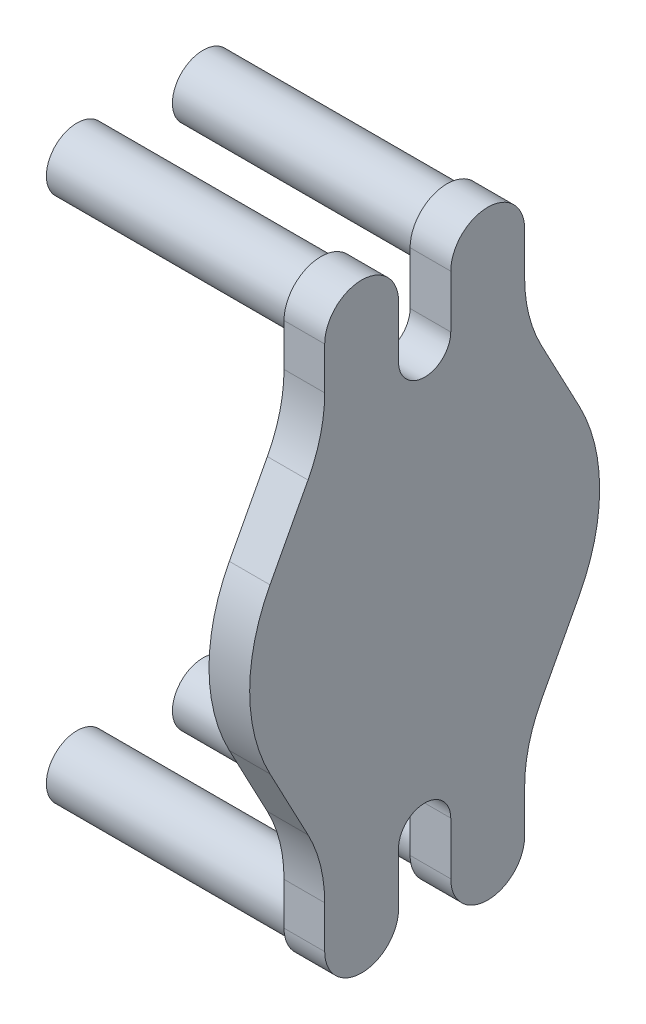
ISO-10303-21;
HEADER;
FILE_DESCRIPTION(('STEP AP214'),'2;1');
FILE_NAME('part.step','',(''),(''),'','','');
FILE_SCHEMA(('AUTOMOTIVE_DESIGN { 1 0 10303 214 1 1 1 1 }'));
ENDSEC;
DATA;
#1=APPLICATION_CONTEXT('core data for automotive mechanical design processes');
#2=APPLICATION_PROTOCOL_DEFINITION('international standard','automotive_design',2000,#1);
#3=PRODUCT_CONTEXT('',#1,'mechanical');
#4=PRODUCT('Part','Part','',(#3));
#5=PRODUCT_RELATED_PRODUCT_CATEGORY('part','',(#4));
#6=PRODUCT_DEFINITION_FORMATION('','',#4);
#7=PRODUCT_DEFINITION_CONTEXT('part definition',#1,'design');
#8=PRODUCT_DEFINITION('design','',#6,#7);
#9=PRODUCT_DEFINITION_SHAPE('','',#8);
#10=(LENGTH_UNIT() NAMED_UNIT(*) SI_UNIT(.MILLI.,.METRE.));
#11=(NAMED_UNIT(*) PLANE_ANGLE_UNIT() SI_UNIT($,.RADIAN.));
#12=(NAMED_UNIT(*) SI_UNIT($,.STERADIAN.) SOLID_ANGLE_UNIT());
#13=UNCERTAINTY_MEASURE_WITH_UNIT(LENGTH_MEASURE(1.E-05),#10,'distance_accuracy_value','');
#14=(GEOMETRIC_REPRESENTATION_CONTEXT(3) GLOBAL_UNCERTAINTY_ASSIGNED_CONTEXT((#13)) GLOBAL_UNIT_ASSIGNED_CONTEXT((#10,
#11,#12)) REPRESENTATION_CONTEXT('',''));
#15=CARTESIAN_POINT('',(0.,0.,0.));
#16=DIRECTION('',(0.,0.,1.));
#17=DIRECTION('',(1.,0.,0.));
#18=AXIS2_PLACEMENT_3D('',#15,#16,#17);
#19=CARTESIAN_POINT('',(33.9,17.1151545626375,32.3245303182742));
#20=DIRECTION('',(0.,-0.467934015820141,-0.883763405464628));
#21=DIRECTION('',(0.,0.883763405464628,-0.467934015820141));
#22=AXIS2_PLACEMENT_3D('',#19,#20,#21);
#23=PLANE('',#22);
#24=DIRECTION('',(0.,-0.883763405464628,0.467934015820141));
#25=VECTOR('',#24,1.);
#26=CARTESIAN_POINT('',(25.4,17.1151545626375,32.3245303182742));
#27=LINE('',#26,#25);
#28=CARTESIAN_POINT('',(25.4,32.1151545626375,24.3823478360612));
#29=VERTEX_POINT('',#28);
#30=CARTESIAN_POINT('',(25.4,17.1151545626375,32.3245303182742));
#31=VERTEX_POINT('',#30);
#32=EDGE_CURVE('E231',#29,#31,#27,.T.);
#33=ORIENTED_EDGE('',*,*,#32,.T.);
#34=DIRECTION('',(-1.,0.,0.));
#35=VECTOR('',#34,1.);
#36=CARTESIAN_POINT('',(33.9,17.1151545626375,32.3245303182742));
#37=LINE('',#36,#35);
#38=CARTESIAN_POINT('',(33.9,17.1151545626375,32.3245303182742));
#39=VERTEX_POINT('',#38);
#40=EDGE_CURVE('E340',#39,#31,#37,.T.);
#41=ORIENTED_EDGE('',*,*,#40,.F.);
#42=DIRECTION('',(0.,-0.883763405464628,0.467934015820141));
#43=VECTOR('',#42,1.);
#44=CARTESIAN_POINT('',(33.9,17.1151545626375,32.3245303182742));
#45=LINE('',#44,#43);
#46=CARTESIAN_POINT('',(33.9,32.1151545626375,24.3823478360612));
#47=VERTEX_POINT('',#46);
#48=EDGE_CURVE('E290',#47,#39,#45,.T.);
#49=ORIENTED_EDGE('',*,*,#48,.F.);
#50=DIRECTION('',(-1.,0.,0.));
#51=VECTOR('',#50,1.);
#52=CARTESIAN_POINT('',(33.9,32.1151545626375,24.3823478360612));
#53=LINE('',#52,#51);
#54=EDGE_CURVE('E227',#47,#29,#53,.T.);
#55=ORIENTED_EDGE('',*,*,#54,.T.);
#56=EDGE_LOOP('',(#33,#41,#49,#55));
#57=FACE_BOUND('',#56,.T.);
#58=ADVANCED_FACE('F37',(#57),#23,.F.);
#59=CARTESIAN_POINT('',(33.9,0.,0.));
#60=DIRECTION('',(-1.,0.,0.));
#61=DIRECTION('',(0.,-1.,0.));
#62=AXIS2_PLACEMENT_3D('',#59,#60,#61);
#63=CYLINDRICAL_SURFACE('',#62,36.576);
#64=CARTESIAN_POINT('',(25.4,0.,0.));
#65=DIRECTION('',(1.,0.,0.));
#66=DIRECTION('',(0.,1.,0.));
#67=AXIS2_PLACEMENT_3D('',#64,#65,#66);
#68=CIRCLE('',#67,36.576);
#69=CARTESIAN_POINT('',(25.4,-17.1151545626375,32.3245303182742));
#70=VERTEX_POINT('',#69);
#71=EDGE_CURVE('E234',#31,#70,#68,.T.);
#72=ORIENTED_EDGE('',*,*,#71,.T.);
#73=DIRECTION('',(-1.,0.,0.));
#74=VECTOR('',#73,1.);
#75=CARTESIAN_POINT('',(33.9,-17.1151545626374,32.3245303182742));
#76=LINE('',#75,#74);
#77=CARTESIAN_POINT('',(33.9,-17.1151545626374,32.3245303182742));
#78=VERTEX_POINT('',#77);
#79=EDGE_CURVE('E338',#78,#70,#76,.T.);
#80=ORIENTED_EDGE('',*,*,#79,.F.);
#81=CARTESIAN_POINT('',(33.9,0.,0.));
#82=DIRECTION('',(1.,0.,0.));
#83=DIRECTION('',(0.,1.,0.));
#84=AXIS2_PLACEMENT_3D('',#81,#82,#83);
#85=CIRCLE('',#84,36.576);
#86=EDGE_CURVE('E146',#39,#78,#85,.T.);
#87=ORIENTED_EDGE('',*,*,#86,.F.);
#88=ORIENTED_EDGE('',*,*,#40,.T.);
#89=EDGE_LOOP('',(#72,#80,#87,#88));
#90=FACE_BOUND('',#89,.T.);
#91=ADVANCED_FACE('F379',(#90),#63,.T.);
#92=CARTESIAN_POINT('',(33.9,-17.1151545626375,32.3245303182742));
#93=DIRECTION('',(0.,-0.467934015820141,0.883763405464628));
#94=DIRECTION('',(0.,-0.883763405464628,-0.467934015820141));
#95=AXIS2_PLACEMENT_3D('',#92,#93,#94);
#96=PLANE('',#95);
#97=DIRECTION('',(0.,0.883763405464628,0.467934015820141));
#98=VECTOR('',#97,1.);
#99=CARTESIAN_POINT('',(25.4,-17.1151545626375,32.3245303182742));
#100=LINE('',#99,#98);
#101=CARTESIAN_POINT('',(25.4,-32.1151545626375,24.3823478360612));
#102=VERTEX_POINT('',#101);
#103=EDGE_CURVE('E238',#102,#70,#100,.T.);
#104=ORIENTED_EDGE('',*,*,#103,.F.);
#105=DIRECTION('',(-1.,0.,0.));
#106=VECTOR('',#105,1.);
#107=CARTESIAN_POINT('',(33.9,-32.1151545626374,24.3823478360612));
#108=LINE('',#107,#106);
#109=CARTESIAN_POINT('',(33.9,-32.1151545626374,24.3823478360612));
#110=VERTEX_POINT('',#109);
#111=EDGE_CURVE('E336',#110,#102,#108,.T.);
#112=ORIENTED_EDGE('',*,*,#111,.F.);
#113=DIRECTION('',(0.,0.883763405464628,0.467934015820141));
#114=VECTOR('',#113,1.);
#115=CARTESIAN_POINT('',(33.9,-17.1151545626375,32.3245303182742));
#116=LINE('',#115,#114);
#117=EDGE_CURVE('E706',#110,#78,#116,.T.);
#118=ORIENTED_EDGE('',*,*,#117,.T.);
#119=ORIENTED_EDGE('',*,*,#79,.T.);
#120=EDGE_LOOP('',(#104,#112,#118,#119));
#121=FACE_BOUND('',#120,.T.);
#122=ADVANCED_FACE('F383',(#121),#96,.T.);
#123=CARTESIAN_POINT('',(33.9,-46.1531750372417,50.89525));
#124=DIRECTION('',(-1.,0.,0.));
#125=DIRECTION('',(0.,-1.,0.));
#126=AXIS2_PLACEMENT_3D('',#123,#124,#125);
#127=CYLINDRICAL_SURFACE('',#126,30.);
#128=CARTESIAN_POINT('',(25.4,-46.1531750372417,50.89525));
#129=DIRECTION('',(1.,0.,0.));
#130=DIRECTION('',(0.,1.,0.));
#131=AXIS2_PLACEMENT_3D('',#128,#129,#130);
#132=CIRCLE('',#131,30.);
#133=CARTESIAN_POINT('',(25.4,-46.1531750372417,20.89525));
#134=VERTEX_POINT('',#133);
#135=EDGE_CURVE('E241',#134,#102,#132,.T.);
#136=ORIENTED_EDGE('',*,*,#135,.F.);
#137=DIRECTION('',(-1.,0.,0.));
#138=VECTOR('',#137,1.);
#139=CARTESIAN_POINT('',(33.9,-46.1531750372417,20.89525));
#140=LINE('',#139,#138);
#141=CARTESIAN_POINT('',(33.9,-46.1531750372417,20.89525));
#142=VERTEX_POINT('',#141);
#143=EDGE_CURVE('E334',#142,#134,#140,.T.);
#144=ORIENTED_EDGE('',*,*,#143,.F.);
#145=CARTESIAN_POINT('',(33.9,-46.1531750372417,50.89525));
#146=DIRECTION('',(1.,0.,0.));
#147=DIRECTION('',(0.,1.,0.));
#148=AXIS2_PLACEMENT_3D('',#145,#146,#147);
#149=CIRCLE('',#148,30.);
#150=EDGE_CURVE('E709',#142,#110,#149,.T.);
#151=ORIENTED_EDGE('',*,*,#150,.T.);
#152=ORIENTED_EDGE('',*,*,#111,.T.);
#153=EDGE_LOOP('',(#136,#144,#151,#152));
#154=FACE_BOUND('',#153,.T.);
#155=ADVANCED_FACE('F387',(#154),#127,.F.);
#156=CARTESIAN_POINT('',(33.9,0.,20.89525));
#157=DIRECTION('',(0.,0.,1.));
#158=DIRECTION('',(0.,-1.,0.));
#159=AXIS2_PLACEMENT_3D('',#156,#157,#158);
#160=PLANE('',#159);
#161=DIRECTION('',(0.,1.,0.));
#162=VECTOR('',#161,1.);
#163=CARTESIAN_POINT('',(25.4,0.,20.89525));
#164=LINE('',#163,#162);
#165=CARTESIAN_POINT('',(25.4,-55.,20.89525));
#166=VERTEX_POINT('',#165);
#167=EDGE_CURVE('E244',#166,#134,#164,.T.);
#168=ORIENTED_EDGE('',*,*,#167,.F.);
#169=DIRECTION('',(-1.,0.,0.));
#170=VECTOR('',#169,1.);
#171=CARTESIAN_POINT('',(33.9,-55.,20.89525));
#172=LINE('',#171,#170);
#173=CARTESIAN_POINT('',(33.9,-55.,20.89525));
#174=VERTEX_POINT('',#173);
#175=EDGE_CURVE('E332',#174,#166,#172,.T.);
#176=ORIENTED_EDGE('',*,*,#175,.F.);
#177=DIRECTION('',(0.,1.,0.));
#178=VECTOR('',#177,1.);
#179=CARTESIAN_POINT('',(33.9,0.,20.89525));
#180=LINE('',#179,#178);
#181=EDGE_CURVE('E712',#174,#142,#180,.T.);
#182=ORIENTED_EDGE('',*,*,#181,.T.);
#183=ORIENTED_EDGE('',*,*,#143,.T.);
#184=EDGE_LOOP('',(#168,#176,#182,#183));
#185=FACE_BOUND('',#184,.T.);
#186=ADVANCED_FACE('F393',(#185),#160,.T.);
#187=CARTESIAN_POINT('',(33.9,-55.,13.175));
#188=DIRECTION('',(-1.,0.,0.));
#189=DIRECTION('',(0.,-1.,0.));
#190=AXIS2_PLACEMENT_3D('',#187,#188,#189);
#191=CYLINDRICAL_SURFACE('',#190,7.72025);
#192=CARTESIAN_POINT('',(25.4,-55.,13.175));
#193=DIRECTION('',(1.,0.,0.));
#194=DIRECTION('',(0.,1.,0.));
#195=AXIS2_PLACEMENT_3D('',#192,#193,#194);
#196=CIRCLE('',#195,7.72025);
#197=CARTESIAN_POINT('',(25.4,-55.,5.45475));
#198=VERTEX_POINT('',#197);
#199=EDGE_CURVE('E247',#166,#198,#196,.T.);
#200=ORIENTED_EDGE('',*,*,#199,.T.);
#201=DIRECTION('',(-1.,0.,0.));
#202=VECTOR('',#201,1.);
#203=CARTESIAN_POINT('',(33.9,-55.,5.45475));
#204=LINE('',#203,#202);
#205=CARTESIAN_POINT('',(33.9,-55.,5.45475));
#206=VERTEX_POINT('',#205);
#207=EDGE_CURVE('E329',#206,#198,#204,.T.);
#208=ORIENTED_EDGE('',*,*,#207,.F.);
#209=CARTESIAN_POINT('',(33.9,-55.,13.175));
#210=DIRECTION('',(1.,0.,0.));
#211=DIRECTION('',(0.,1.,0.));
#212=AXIS2_PLACEMENT_3D('',#209,#210,#211);
#213=CIRCLE('',#212,7.72025);
#214=EDGE_CURVE('E715',#174,#206,#213,.T.);
#215=ORIENTED_EDGE('',*,*,#214,.F.);
#216=ORIENTED_EDGE('',*,*,#175,.T.);
#217=EDGE_LOOP('',(#200,#208,#215,#216));
#218=FACE_BOUND('',#217,.T.);
#219=ADVANCED_FACE('F397',(#218),#191,.T.);
#220=CARTESIAN_POINT('',(33.9,0.,5.45475000000001));
#221=DIRECTION('',(0.,0.,1.));
#222=DIRECTION('',(0.,-1.,0.));
#223=AXIS2_PLACEMENT_3D('',#220,#221,#222);
#224=PLANE('',#223);
#225=DIRECTION('',(0.,1.,0.));
#226=VECTOR('',#225,1.);
#227=CARTESIAN_POINT('',(25.4,0.,5.45475000000001));
#228=LINE('',#227,#226);
#229=CARTESIAN_POINT('',(25.4,-44.,5.45475));
#230=VERTEX_POINT('',#229);
#231=EDGE_CURVE('E249',#198,#230,#228,.T.);
#232=ORIENTED_EDGE('',*,*,#231,.T.);
#233=DIRECTION('',(-1.,0.,0.));
#234=VECTOR('',#233,1.);
#235=CARTESIAN_POINT('',(33.9,-44.,5.45475));
#236=LINE('',#235,#234);
#237=CARTESIAN_POINT('',(33.9,-44.,5.45475));
#238=VERTEX_POINT('',#237);
#239=EDGE_CURVE('E326',#238,#230,#236,.T.);
#240=ORIENTED_EDGE('',*,*,#239,.F.);
#241=DIRECTION('',(0.,1.,0.));
#242=VECTOR('',#241,1.);
#243=CARTESIAN_POINT('',(33.9,0.,5.45475000000001));
#244=LINE('',#243,#242);
#245=EDGE_CURVE('E717',#206,#238,#244,.T.);
#246=ORIENTED_EDGE('',*,*,#245,.F.);
#247=ORIENTED_EDGE('',*,*,#207,.T.);
#248=EDGE_LOOP('',(#232,#240,#246,#247));
#249=FACE_BOUND('',#248,.T.);
#250=ADVANCED_FACE('F401',(#249),#224,.F.);
#251=CARTESIAN_POINT('',(33.9,-44.,0.));
#252=DIRECTION('',(-1.,0.,0.));
#253=DIRECTION('',(0.,-1.,0.));
#254=AXIS2_PLACEMENT_3D('',#251,#252,#253);
#255=CYLINDRICAL_SURFACE('',#254,5.45475);
#256=CARTESIAN_POINT('',(25.4,-44.,0.));
#257=DIRECTION('',(1.,0.,0.));
#258=DIRECTION('',(0.,1.,0.));
#259=AXIS2_PLACEMENT_3D('',#256,#257,#258);
#260=CIRCLE('',#259,5.45475);
#261=CARTESIAN_POINT('',(25.4,-44.,-5.45474999999999));
#262=VERTEX_POINT('',#261);
#263=EDGE_CURVE('E251',#230,#262,#260,.F.);
#264=ORIENTED_EDGE('',*,*,#263,.T.);
#265=DIRECTION('',(-1.,0.,0.));
#266=VECTOR('',#265,1.);
#267=CARTESIAN_POINT('',(33.9,-44.,-5.45474999999999));
#268=LINE('',#267,#266);
#269=CARTESIAN_POINT('',(33.9,-44.,-5.45474999999999));
#270=VERTEX_POINT('',#269);
#271=EDGE_CURVE('E323',#270,#262,#268,.T.);
#272=ORIENTED_EDGE('',*,*,#271,.F.);
#273=CARTESIAN_POINT('',(33.9,-44.,0.));
#274=DIRECTION('',(1.,0.,0.));
#275=DIRECTION('',(0.,1.,0.));
#276=AXIS2_PLACEMENT_3D('',#273,#274,#275);
#277=CIRCLE('',#276,5.45475);
#278=EDGE_CURVE('E719',#238,#270,#277,.F.);
#279=ORIENTED_EDGE('',*,*,#278,.F.);
#280=ORIENTED_EDGE('',*,*,#239,.T.);
#281=EDGE_LOOP('',(#264,#272,#279,#280));
#282=FACE_BOUND('',#281,.T.);
#283=ADVANCED_FACE('F405',(#282),#255,.F.);
#284=CARTESIAN_POINT('',(33.9,0.,-5.45474999999999));
#285=DIRECTION('',(0.,0.,-1.));
#286=DIRECTION('',(0.,1.,0.));
#287=AXIS2_PLACEMENT_3D('',#284,#285,#286);
#288=PLANE('',#287);
#289=DIRECTION('',(0.,-1.,0.));
#290=VECTOR('',#289,1.);
#291=CARTESIAN_POINT('',(25.4,0.,-5.45474999999999));
#292=LINE('',#291,#290);
#293=CARTESIAN_POINT('',(25.4,-55.,-5.45474999999999));
#294=VERTEX_POINT('',#293);
#295=EDGE_CURVE('E253',#262,#294,#292,.T.);
#296=ORIENTED_EDGE('',*,*,#295,.T.);
#297=DIRECTION('',(-1.,0.,0.));
#298=VECTOR('',#297,1.);
#299=CARTESIAN_POINT('',(33.9,-55.,-5.45474999999999));
#300=LINE('',#299,#298);
#301=CARTESIAN_POINT('',(33.9,-55.,-5.45474999999999));
#302=VERTEX_POINT('',#301);
#303=EDGE_CURVE('E320',#302,#294,#300,.T.);
#304=ORIENTED_EDGE('',*,*,#303,.F.);
#305=DIRECTION('',(0.,-1.,0.));
#306=VECTOR('',#305,1.);
#307=CARTESIAN_POINT('',(33.9,0.,-5.45474999999999));
#308=LINE('',#307,#306);
#309=EDGE_CURVE('E721',#270,#302,#308,.T.);
#310=ORIENTED_EDGE('',*,*,#309,.F.);
#311=ORIENTED_EDGE('',*,*,#271,.T.);
#312=EDGE_LOOP('',(#296,#304,#310,#311));
#313=FACE_BOUND('',#312,.T.);
#314=ADVANCED_FACE('F409',(#313),#288,.F.);
#315=CARTESIAN_POINT('',(33.9,-55.,-13.175));
#316=DIRECTION('',(-1.,0.,0.));
#317=DIRECTION('',(0.,-1.,0.));
#318=AXIS2_PLACEMENT_3D('',#315,#316,#317);
#319=CYLINDRICAL_SURFACE('',#318,7.72025);
#320=CARTESIAN_POINT('',(25.4,-55.,-13.175));
#321=DIRECTION('',(1.,0.,0.));
#322=DIRECTION('',(0.,1.,0.));
#323=AXIS2_PLACEMENT_3D('',#320,#321,#322);
#324=CIRCLE('',#323,7.72025);
#325=CARTESIAN_POINT('',(25.4,-55.,-20.89525));
#326=VERTEX_POINT('',#325);
#327=EDGE_CURVE('E255',#294,#326,#324,.T.);
#328=ORIENTED_EDGE('',*,*,#327,.T.);
#329=DIRECTION('',(-1.,0.,0.));
#330=VECTOR('',#329,1.);
#331=CARTESIAN_POINT('',(33.9,-55.,-20.89525));
#332=LINE('',#331,#330);
#333=CARTESIAN_POINT('',(33.9,-55.,-20.89525));
#334=VERTEX_POINT('',#333);
#335=EDGE_CURVE('E317',#334,#326,#332,.T.);
#336=ORIENTED_EDGE('',*,*,#335,.F.);
#337=CARTESIAN_POINT('',(33.9,-55.,-13.175));
#338=DIRECTION('',(1.,0.,0.));
#339=DIRECTION('',(0.,1.,0.));
#340=AXIS2_PLACEMENT_3D('',#337,#338,#339);
#341=CIRCLE('',#340,7.72025);
#342=EDGE_CURVE('E723',#302,#334,#341,.T.);
#343=ORIENTED_EDGE('',*,*,#342,.F.);
#344=ORIENTED_EDGE('',*,*,#303,.T.);
#345=EDGE_LOOP('',(#328,#336,#343,#344));
#346=FACE_BOUND('',#345,.T.);
#347=ADVANCED_FACE('F413',(#346),#319,.T.);
#348=CARTESIAN_POINT('',(33.9,0.,-20.89525));
#349=DIRECTION('',(0.,0.,1.));
#350=DIRECTION('',(1.,0.,0.));
#351=AXIS2_PLACEMENT_3D('',#348,#349,#350);
#352=PLANE('',#351);
#353=DIRECTION('',(0.,1.,0.));
#354=VECTOR('',#353,1.);
#355=CARTESIAN_POINT('',(25.4,0.,-20.89525));
#356=LINE('',#355,#354);
#357=CARTESIAN_POINT('',(25.4,-46.1531750372417,-20.89525));
#358=VERTEX_POINT('',#357);
#359=EDGE_CURVE('E257',#326,#358,#356,.T.);
#360=ORIENTED_EDGE('',*,*,#359,.T.);
#361=DIRECTION('',(-1.,0.,0.));
#362=VECTOR('',#361,1.);
#363=CARTESIAN_POINT('',(33.9,-46.1531750372417,-20.89525));
#364=LINE('',#363,#362);
#365=CARTESIAN_POINT('',(33.9,-46.1531750372417,-20.89525));
#366=VERTEX_POINT('',#365);
#367=EDGE_CURVE('E314',#366,#358,#364,.T.);
#368=ORIENTED_EDGE('',*,*,#367,.F.);
#369=DIRECTION('',(0.,1.,0.));
#370=VECTOR('',#369,1.);
#371=CARTESIAN_POINT('',(33.9,0.,-20.89525));
#372=LINE('',#371,#370);
#373=EDGE_CURVE('E725',#334,#366,#372,.T.);
#374=ORIENTED_EDGE('',*,*,#373,.F.);
#375=ORIENTED_EDGE('',*,*,#335,.T.);
#376=EDGE_LOOP('',(#360,#368,#374,#375));
#377=FACE_BOUND('',#376,.T.);
#378=ADVANCED_FACE('F417',(#377),#352,.F.);
#379=CARTESIAN_POINT('',(33.9,-46.1531750372417,-50.89525));
#380=DIRECTION('',(-1.,0.,0.));
#381=DIRECTION('',(0.,-1.,0.));
#382=AXIS2_PLACEMENT_3D('',#379,#380,#381);
#383=CYLINDRICAL_SURFACE('',#382,30.);
#384=CARTESIAN_POINT('',(25.4,-46.1531750372417,-50.89525));
#385=DIRECTION('',(1.,0.,0.));
#386=DIRECTION('',(0.,1.,0.));
#387=AXIS2_PLACEMENT_3D('',#384,#385,#386);
#388=CIRCLE('',#387,30.);
#389=CARTESIAN_POINT('',(25.4,-32.1151545626375,-24.3823478360612));
#390=VERTEX_POINT('',#389);
#391=EDGE_CURVE('E259',#358,#390,#388,.F.);
#392=ORIENTED_EDGE('',*,*,#391,.T.);
#393=DIRECTION('',(-1.,0.,0.));
#394=VECTOR('',#393,1.);
#395=CARTESIAN_POINT('',(33.9,-32.1151545626375,-24.3823478360612));
#396=LINE('',#395,#394);
#397=CARTESIAN_POINT('',(33.9,-32.1151545626375,-24.3823478360612));
#398=VERTEX_POINT('',#397);
#399=EDGE_CURVE('E311',#398,#390,#396,.T.);
#400=ORIENTED_EDGE('',*,*,#399,.F.);
#401=CARTESIAN_POINT('',(33.9,-46.1531750372417,-50.89525));
#402=DIRECTION('',(1.,0.,0.));
#403=DIRECTION('',(0.,1.,0.));
#404=AXIS2_PLACEMENT_3D('',#401,#402,#403);
#405=CIRCLE('',#404,30.);
#406=EDGE_CURVE('E727',#366,#398,#405,.F.);
#407=ORIENTED_EDGE('',*,*,#406,.F.);
#408=ORIENTED_EDGE('',*,*,#367,.T.);
#409=EDGE_LOOP('',(#392,#400,#407,#408));
#410=FACE_BOUND('',#409,.T.);
#411=ADVANCED_FACE('F421',(#410),#383,.F.);
#412=CARTESIAN_POINT('',(33.9,-17.1151545626375,-32.3245303182742));
#413=DIRECTION('',(0.,0.467934015820141,0.883763405464628));
#414=DIRECTION('',(0.,-0.883763405464628,0.467934015820141));
#415=AXIS2_PLACEMENT_3D('',#412,#413,#414);
#416=PLANE('',#415);
#417=DIRECTION('',(0.,0.883763405464628,-0.467934015820141));
#418=VECTOR('',#417,1.);
#419=CARTESIAN_POINT('',(25.4,-17.1151545626375,-32.3245303182742));
#420=LINE('',#419,#418);
#421=CARTESIAN_POINT('',(25.4,-17.1151545626375,-32.3245303182742));
#422=VERTEX_POINT('',#421);
#423=EDGE_CURVE('E261',#390,#422,#420,.T.);
#424=ORIENTED_EDGE('',*,*,#423,.T.);
#425=DIRECTION('',(-1.,0.,0.));
#426=VECTOR('',#425,1.);
#427=CARTESIAN_POINT('',(33.9,-17.1151545626375,-32.3245303182742));
#428=LINE('',#427,#426);
#429=CARTESIAN_POINT('',(33.9,-17.1151545626375,-32.3245303182742));
#430=VERTEX_POINT('',#429);
#431=EDGE_CURVE('E308',#430,#422,#428,.T.);
#432=ORIENTED_EDGE('',*,*,#431,.F.);
#433=DIRECTION('',(0.,0.883763405464628,-0.467934015820141));
#434=VECTOR('',#433,1.);
#435=CARTESIAN_POINT('',(33.9,-17.1151545626375,-32.3245303182742));
#436=LINE('',#435,#434);
#437=EDGE_CURVE('E729',#398,#430,#436,.T.);
#438=ORIENTED_EDGE('',*,*,#437,.F.);
#439=ORIENTED_EDGE('',*,*,#399,.T.);
#440=EDGE_LOOP('',(#424,#432,#438,#439));
#441=FACE_BOUND('',#440,.T.);
#442=ADVANCED_FACE('F425',(#441),#416,.F.);
#443=CARTESIAN_POINT('',(33.9,0.,0.));
#444=DIRECTION('',(-1.,0.,0.));
#445=DIRECTION('',(0.,-1.,0.));
#446=AXIS2_PLACEMENT_3D('',#443,#444,#445);
#447=CYLINDRICAL_SURFACE('',#446,36.576);
#448=CARTESIAN_POINT('',(25.4,0.,0.));
#449=DIRECTION('',(1.,0.,0.));
#450=DIRECTION('',(0.,1.,0.));
#451=AXIS2_PLACEMENT_3D('',#448,#449,#450);
#452=CIRCLE('',#451,36.576);
#453=CARTESIAN_POINT('',(25.4,17.1151545626375,-32.3245303182742));
#454=VERTEX_POINT('',#453);
#455=EDGE_CURVE('E263',#422,#454,#452,.T.);
#456=ORIENTED_EDGE('',*,*,#455,.T.);
#457=DIRECTION('',(-1.,0.,0.));
#458=VECTOR('',#457,1.);
#459=CARTESIAN_POINT('',(33.9,17.1151545626375,-32.3245303182742));
#460=LINE('',#459,#458);
#461=CARTESIAN_POINT('',(33.9,17.1151545626375,-32.3245303182742));
#462=VERTEX_POINT('',#461);
#463=EDGE_CURVE('E306',#462,#454,#460,.T.);
#464=ORIENTED_EDGE('',*,*,#463,.F.);
#465=CARTESIAN_POINT('',(33.9,0.,0.));
#466=DIRECTION('',(1.,0.,0.));
#467=DIRECTION('',(0.,1.,0.));
#468=AXIS2_PLACEMENT_3D('',#465,#466,#467);
#469=CIRCLE('',#468,36.576);
#470=EDGE_CURVE('E731',#430,#462,#469,.T.);
#471=ORIENTED_EDGE('',*,*,#470,.F.);
#472=ORIENTED_EDGE('',*,*,#431,.T.);
#473=EDGE_LOOP('',(#456,#464,#471,#472));
#474=FACE_BOUND('',#473,.T.);
#475=ADVANCED_FACE('F429',(#474),#447,.T.);
#476=CARTESIAN_POINT('',(33.9,17.1151545626375,-32.3245303182742));
#477=DIRECTION('',(0.,0.467934015820141,-0.883763405464628));
#478=DIRECTION('',(0.,0.883763405464628,0.467934015820141));
#479=AXIS2_PLACEMENT_3D('',#476,#477,#478);
#480=PLANE('',#479);
#481=DIRECTION('',(0.,-0.883763405464628,-0.467934015820141));
#482=VECTOR('',#481,1.);
#483=CARTESIAN_POINT('',(25.4,17.1151545626375,-32.3245303182742));
#484=LINE('',#483,#482);
#485=CARTESIAN_POINT('',(25.4,32.1151545626375,-24.3823478360612));
#486=VERTEX_POINT('',#485);
#487=EDGE_CURVE('E266',#486,#454,#484,.T.);
#488=ORIENTED_EDGE('',*,*,#487,.F.);
#489=DIRECTION('',(-1.,0.,0.));
#490=VECTOR('',#489,1.);
#491=CARTESIAN_POINT('',(33.9,32.1151545626375,-24.3823478360612));
#492=LINE('',#491,#490);
#493=CARTESIAN_POINT('',(33.9,32.1151545626375,-24.3823478360612));
#494=VERTEX_POINT('',#493);
#495=EDGE_CURVE('E304',#494,#486,#492,.T.);
#496=ORIENTED_EDGE('',*,*,#495,.F.);
#497=DIRECTION('',(0.,-0.883763405464628,-0.467934015820141));
#498=VECTOR('',#497,1.);
#499=CARTESIAN_POINT('',(33.9,17.1151545626375,-32.3245303182742));
#500=LINE('',#499,#498);
#501=EDGE_CURVE('E733',#494,#462,#500,.T.);
#502=ORIENTED_EDGE('',*,*,#501,.T.);
#503=ORIENTED_EDGE('',*,*,#463,.T.);
#504=EDGE_LOOP('',(#488,#496,#502,#503));
#505=FACE_BOUND('',#504,.T.);
#506=ADVANCED_FACE('F433',(#505),#480,.T.);
#507=CARTESIAN_POINT('',(33.9,46.1531750372417,-50.89525));
#508=DIRECTION('',(-1.,0.,0.));
#509=DIRECTION('',(0.,-1.,0.));
#510=AXIS2_PLACEMENT_3D('',#507,#508,#509);
#511=CYLINDRICAL_SURFACE('',#510,30.);
#512=CARTESIAN_POINT('',(25.4,46.1531750372417,-50.89525));
#513=DIRECTION('',(1.,0.,0.));
#514=DIRECTION('',(0.,1.,0.));
#515=AXIS2_PLACEMENT_3D('',#512,#513,#514);
#516=CIRCLE('',#515,30.);
#517=CARTESIAN_POINT('',(25.4,46.1531750372417,-20.89525));
#518=VERTEX_POINT('',#517);
#519=EDGE_CURVE('E269',#518,#486,#516,.T.);
#520=ORIENTED_EDGE('',*,*,#519,.F.);
#521=DIRECTION('',(-1.,0.,0.));
#522=VECTOR('',#521,1.);
#523=CARTESIAN_POINT('',(33.9,46.1531750372417,-20.89525));
#524=LINE('',#523,#522);
#525=CARTESIAN_POINT('',(33.9,46.1531750372417,-20.89525));
#526=VERTEX_POINT('',#525);
#527=EDGE_CURVE('E302',#526,#518,#524,.T.);
#528=ORIENTED_EDGE('',*,*,#527,.F.);
#529=CARTESIAN_POINT('',(33.9,46.1531750372417,-50.89525));
#530=DIRECTION('',(1.,0.,0.));
#531=DIRECTION('',(0.,1.,0.));
#532=AXIS2_PLACEMENT_3D('',#529,#530,#531);
#533=CIRCLE('',#532,30.);
#534=EDGE_CURVE('E736',#526,#494,#533,.T.);
#535=ORIENTED_EDGE('',*,*,#534,.T.);
#536=ORIENTED_EDGE('',*,*,#495,.T.);
#537=EDGE_LOOP('',(#520,#528,#535,#536));
#538=FACE_BOUND('',#537,.T.);
#539=ADVANCED_FACE('F437',(#538),#511,.F.);
#540=CARTESIAN_POINT('',(33.9,0.,-20.89525));
#541=DIRECTION('',(0.,0.,-1.));
#542=DIRECTION('',(-1.,0.,0.));
#543=AXIS2_PLACEMENT_3D('',#540,#541,#542);
#544=PLANE('',#543);
#545=DIRECTION('',(0.,-1.,0.));
#546=VECTOR('',#545,1.);
#547=CARTESIAN_POINT('',(25.4,0.,-20.89525));
#548=LINE('',#547,#546);
#549=CARTESIAN_POINT('',(25.4,55.,-20.89525));
#550=VERTEX_POINT('',#549);
#551=EDGE_CURVE('E272',#550,#518,#548,.T.);
#552=ORIENTED_EDGE('',*,*,#551,.F.);
#553=DIRECTION('',(-1.,0.,0.));
#554=VECTOR('',#553,1.);
#555=CARTESIAN_POINT('',(33.9,55.,-20.89525));
#556=LINE('',#555,#554);
#557=CARTESIAN_POINT('',(33.9,55.,-20.89525));
#558=VERTEX_POINT('',#557);
#559=EDGE_CURVE('E300',#558,#550,#556,.T.);
#560=ORIENTED_EDGE('',*,*,#559,.F.);
#561=DIRECTION('',(0.,-1.,0.));
#562=VECTOR('',#561,1.);
#563=CARTESIAN_POINT('',(33.9,0.,-20.89525));
#564=LINE('',#563,#562);
#565=EDGE_CURVE('E739',#558,#526,#564,.T.);
#566=ORIENTED_EDGE('',*,*,#565,.T.);
#567=ORIENTED_EDGE('',*,*,#527,.T.);
#568=EDGE_LOOP('',(#552,#560,#566,#567));
#569=FACE_BOUND('',#568,.T.);
#570=ADVANCED_FACE('F441',(#569),#544,.T.);
#571=CARTESIAN_POINT('',(33.9,55.,-13.175));
#572=DIRECTION('',(-1.,0.,0.));
#573=DIRECTION('',(0.,-1.,0.));
#574=AXIS2_PLACEMENT_3D('',#571,#572,#573);
#575=CYLINDRICAL_SURFACE('',#574,7.72025);
#576=CARTESIAN_POINT('',(25.4,55.,-13.175));
#577=DIRECTION('',(1.,0.,0.));
#578=DIRECTION('',(0.,1.,0.));
#579=AXIS2_PLACEMENT_3D('',#576,#577,#578);
#580=CIRCLE('',#579,7.72025);
#581=CARTESIAN_POINT('',(25.4,55.,-5.45474999999999));
#582=VERTEX_POINT('',#581);
#583=EDGE_CURVE('E275',#550,#582,#580,.T.);
#584=ORIENTED_EDGE('',*,*,#583,.T.);
#585=DIRECTION('',(-1.,0.,0.));
#586=VECTOR('',#585,1.);
#587=CARTESIAN_POINT('',(33.9,55.,-5.45474999999999));
#588=LINE('',#587,#586);
#589=CARTESIAN_POINT('',(33.9,55.,-5.45474999999999));
#590=VERTEX_POINT('',#589);
#591=EDGE_CURVE('E298',#590,#582,#588,.T.);
#592=ORIENTED_EDGE('',*,*,#591,.F.);
#593=CARTESIAN_POINT('',(33.9,55.,-13.175));
#594=DIRECTION('',(1.,0.,0.));
#595=DIRECTION('',(0.,1.,0.));
#596=AXIS2_PLACEMENT_3D('',#593,#594,#595);
#597=CIRCLE('',#596,7.72025);
#598=EDGE_CURVE('E742',#558,#590,#597,.T.);
#599=ORIENTED_EDGE('',*,*,#598,.F.);
#600=ORIENTED_EDGE('',*,*,#559,.T.);
#601=EDGE_LOOP('',(#584,#592,#599,#600));
#602=FACE_BOUND('',#601,.T.);
#603=ADVANCED_FACE('F445',(#602),#575,.T.);
#604=CARTESIAN_POINT('',(33.9,0.,-5.45474999999999));
#605=DIRECTION('',(0.,0.,1.));
#606=DIRECTION('',(0.,-1.,0.));
#607=AXIS2_PLACEMENT_3D('',#604,#605,#606);
#608=PLANE('',#607);
#609=DIRECTION('',(0.,1.,0.));
#610=VECTOR('',#609,1.);
#611=CARTESIAN_POINT('',(25.4,0.,-5.45474999999999));
#612=LINE('',#611,#610);
#613=CARTESIAN_POINT('',(25.4,44.,-5.45474999999999));
#614=VERTEX_POINT('',#613);
#615=EDGE_CURVE('E278',#614,#582,#612,.T.);
#616=ORIENTED_EDGE('',*,*,#615,.F.);
#617=DIRECTION('',(-1.,0.,0.));
#618=VECTOR('',#617,1.);
#619=CARTESIAN_POINT('',(33.9,44.,-5.45474999999999));
#620=LINE('',#619,#618);
#621=CARTESIAN_POINT('',(33.9,44.,-5.45474999999999));
#622=VERTEX_POINT('',#621);
#623=EDGE_CURVE('E296',#622,#614,#620,.T.);
#624=ORIENTED_EDGE('',*,*,#623,.F.);
#625=DIRECTION('',(0.,1.,0.));
#626=VECTOR('',#625,1.);
#627=CARTESIAN_POINT('',(33.9,0.,-5.45474999999999));
#628=LINE('',#627,#626);
#629=EDGE_CURVE('E744',#622,#590,#628,.T.);
#630=ORIENTED_EDGE('',*,*,#629,.T.);
#631=ORIENTED_EDGE('',*,*,#591,.T.);
#632=EDGE_LOOP('',(#616,#624,#630,#631));
#633=FACE_BOUND('',#632,.T.);
#634=ADVANCED_FACE('F449',(#633),#608,.T.);
#635=CARTESIAN_POINT('',(33.9,44.,0.));
#636=DIRECTION('',(-1.,0.,0.));
#637=DIRECTION('',(0.,-1.,0.));
#638=AXIS2_PLACEMENT_3D('',#635,#636,#637);
#639=CYLINDRICAL_SURFACE('',#638,5.45475);
#640=CARTESIAN_POINT('',(25.4,44.,0.));
#641=DIRECTION('',(1.,0.,0.));
#642=DIRECTION('',(0.,1.,0.));
#643=AXIS2_PLACEMENT_3D('',#640,#641,#642);
#644=CIRCLE('',#643,5.45475);
#645=CARTESIAN_POINT('',(25.4,44.,5.45475));
#646=VERTEX_POINT('',#645);
#647=EDGE_CURVE('E281',#646,#614,#644,.T.);
#648=ORIENTED_EDGE('',*,*,#647,.F.);
#649=DIRECTION('',(-1.,0.,0.));
#650=VECTOR('',#649,1.);
#651=CARTESIAN_POINT('',(33.9,44.,5.45475));
#652=LINE('',#651,#650);
#653=CARTESIAN_POINT('',(33.9,44.,5.45475));
#654=VERTEX_POINT('',#653);
#655=EDGE_CURVE('E294',#654,#646,#652,.T.);
#656=ORIENTED_EDGE('',*,*,#655,.F.);
#657=CARTESIAN_POINT('',(33.9,44.,0.));
#658=DIRECTION('',(1.,0.,0.));
#659=DIRECTION('',(0.,1.,0.));
#660=AXIS2_PLACEMENT_3D('',#657,#658,#659);
#661=CIRCLE('',#660,5.45475);
#662=EDGE_CURVE('E747',#654,#622,#661,.T.);
#663=ORIENTED_EDGE('',*,*,#662,.T.);
#664=ORIENTED_EDGE('',*,*,#623,.T.);
#665=EDGE_LOOP('',(#648,#656,#663,#664));
#666=FACE_BOUND('',#665,.T.);
#667=ADVANCED_FACE('F453',(#666),#639,.F.);
#668=CARTESIAN_POINT('',(33.9,0.,5.45475000000001));
#669=DIRECTION('',(0.,0.,-1.));
#670=DIRECTION('',(0.,1.,0.));
#671=AXIS2_PLACEMENT_3D('',#668,#669,#670);
#672=PLANE('',#671);
#673=DIRECTION('',(0.,-1.,0.));
#674=VECTOR('',#673,1.);
#675=CARTESIAN_POINT('',(25.4,0.,5.45475000000001));
#676=LINE('',#675,#674);
#677=CARTESIAN_POINT('',(25.4,55.,5.45475));
#678=VERTEX_POINT('',#677);
#679=EDGE_CURVE('E284',#678,#646,#676,.T.);
#680=ORIENTED_EDGE('',*,*,#679,.F.);
#681=DIRECTION('',(-1.,0.,0.));
#682=VECTOR('',#681,1.);
#683=CARTESIAN_POINT('',(33.9,55.,5.45475));
#684=LINE('',#683,#682);
#685=CARTESIAN_POINT('',(33.9,55.,5.45475));
#686=VERTEX_POINT('',#685);
#687=EDGE_CURVE('E222',#686,#678,#684,.T.);
#688=ORIENTED_EDGE('',*,*,#687,.F.);
#689=DIRECTION('',(0.,-1.,0.));
#690=VECTOR('',#689,1.);
#691=CARTESIAN_POINT('',(33.9,0.,5.45475000000001));
#692=LINE('',#691,#690);
#693=EDGE_CURVE('E215',#686,#654,#692,.T.);
#694=ORIENTED_EDGE('',*,*,#693,.T.);
#695=ORIENTED_EDGE('',*,*,#655,.T.);
#696=EDGE_LOOP('',(#680,#688,#694,#695));
#697=FACE_BOUND('',#696,.T.);
#698=ADVANCED_FACE('F457',(#697),#672,.T.);
#699=CARTESIAN_POINT('',(33.9,55.,13.175));
#700=DIRECTION('',(-1.,0.,0.));
#701=DIRECTION('',(0.,-1.,0.));
#702=AXIS2_PLACEMENT_3D('',#699,#700,#701);
#703=CYLINDRICAL_SURFACE('',#702,7.72025);
#704=CARTESIAN_POINT('',(25.4,55.,13.175));
#705=DIRECTION('',(1.,0.,0.));
#706=DIRECTION('',(0.,1.,0.));
#707=AXIS2_PLACEMENT_3D('',#704,#705,#706);
#708=CIRCLE('',#707,7.72025);
#709=CARTESIAN_POINT('',(25.4,55.,20.89525));
#710=VERTEX_POINT('',#709);
#711=EDGE_CURVE('E221',#678,#710,#708,.T.);
#712=ORIENTED_EDGE('',*,*,#711,.T.);
#713=DIRECTION('',(-1.,0.,0.));
#714=VECTOR('',#713,1.);
#715=CARTESIAN_POINT('',(33.9,55.,20.89525));
#716=LINE('',#715,#714);
#717=CARTESIAN_POINT('',(33.9,55.,20.89525));
#718=VERTEX_POINT('',#717);
#719=EDGE_CURVE('E218',#718,#710,#716,.T.);
#720=ORIENTED_EDGE('',*,*,#719,.F.);
#721=CARTESIAN_POINT('',(33.9,55.,13.175));
#722=DIRECTION('',(1.,0.,0.));
#723=DIRECTION('',(0.,1.,0.));
#724=AXIS2_PLACEMENT_3D('',#721,#722,#723);
#725=CIRCLE('',#724,7.72025);
#726=EDGE_CURVE('E208',#686,#718,#725,.T.);
#727=ORIENTED_EDGE('',*,*,#726,.F.);
#728=ORIENTED_EDGE('',*,*,#687,.T.);
#729=EDGE_LOOP('',(#712,#720,#727,#728));
#730=FACE_BOUND('',#729,.T.);
#731=ADVANCED_FACE('F219',(#730),#703,.T.);
#732=CARTESIAN_POINT('',(33.9,0.,20.89525));
#733=DIRECTION('',(0.,0.,-1.));
#734=DIRECTION('',(0.,1.,0.));
#735=AXIS2_PLACEMENT_3D('',#732,#733,#734);
#736=PLANE('',#735);
#737=DIRECTION('',(0.,-1.,0.));
#738=VECTOR('',#737,1.);
#739=CARTESIAN_POINT('',(25.4,0.,20.89525));
#740=LINE('',#739,#738);
#741=CARTESIAN_POINT('',(25.4,46.1531750372417,20.89525));
#742=VERTEX_POINT('',#741);
#743=EDGE_CURVE('E131',#710,#742,#740,.T.);
#744=ORIENTED_EDGE('',*,*,#743,.T.);
#745=DIRECTION('',(-1.,0.,0.));
#746=VECTOR('',#745,1.);
#747=CARTESIAN_POINT('',(33.9,46.1531750372417,20.89525));
#748=LINE('',#747,#746);
#749=CARTESIAN_POINT('',(33.9,46.1531750372417,20.89525));
#750=VERTEX_POINT('',#749);
#751=EDGE_CURVE('E223',#750,#742,#748,.T.);
#752=ORIENTED_EDGE('',*,*,#751,.F.);
#753=DIRECTION('',(0.,-1.,0.));
#754=VECTOR('',#753,1.);
#755=CARTESIAN_POINT('',(33.9,0.,20.89525));
#756=LINE('',#755,#754);
#757=EDGE_CURVE('E212',#718,#750,#756,.T.);
#758=ORIENTED_EDGE('',*,*,#757,.F.);
#759=ORIENTED_EDGE('',*,*,#719,.T.);
#760=EDGE_LOOP('',(#744,#752,#758,#759));
#761=FACE_BOUND('',#760,.T.);
#762=ADVANCED_FACE('F225',(#761),#736,.F.);
#763=CARTESIAN_POINT('',(33.9,46.1531750372417,50.89525));
#764=DIRECTION('',(-1.,0.,0.));
#765=DIRECTION('',(0.,-1.,0.));
#766=AXIS2_PLACEMENT_3D('',#763,#764,#765);
#767=CYLINDRICAL_SURFACE('',#766,30.);
#768=CARTESIAN_POINT('',(25.4,46.1531750372417,50.89525));
#769=DIRECTION('',(1.,0.,0.));
#770=DIRECTION('',(0.,1.,0.));
#771=AXIS2_PLACEMENT_3D('',#768,#769,#770);
#772=CIRCLE('',#771,30.);
#773=EDGE_CURVE('E137',#742,#29,#772,.F.);
#774=ORIENTED_EDGE('',*,*,#773,.T.);
#775=ORIENTED_EDGE('',*,*,#54,.F.);
#776=CARTESIAN_POINT('',(33.9,46.1531750372417,50.89525));
#777=DIRECTION('',(1.,0.,0.));
#778=DIRECTION('',(0.,1.,0.));
#779=AXIS2_PLACEMENT_3D('',#776,#777,#778);
#780=CIRCLE('',#779,30.);
#781=EDGE_CURVE('E54',#750,#47,#780,.F.);
#782=ORIENTED_EDGE('',*,*,#781,.F.);
#783=ORIENTED_EDGE('',*,*,#751,.T.);
#784=EDGE_LOOP('',(#774,#775,#782,#783));
#785=FACE_BOUND('',#784,.T.);
#786=ADVANCED_FACE('F369',(#785),#767,.F.);
#787=CARTESIAN_POINT('',(33.9,0.,0.));
#788=DIRECTION('',(1.,0.,0.));
#789=DIRECTION('',(0.,1.,0.));
#790=AXIS2_PLACEMENT_3D('',#787,#788,#789);
#791=PLANE('',#790);
#792=ORIENTED_EDGE('',*,*,#48,.T.);
#793=ORIENTED_EDGE('',*,*,#86,.T.);
#794=ORIENTED_EDGE('',*,*,#117,.F.);
#795=ORIENTED_EDGE('',*,*,#150,.F.);
#796=ORIENTED_EDGE('',*,*,#181,.F.);
#797=ORIENTED_EDGE('',*,*,#214,.T.);
#798=ORIENTED_EDGE('',*,*,#245,.T.);
#799=ORIENTED_EDGE('',*,*,#278,.T.);
#800=ORIENTED_EDGE('',*,*,#309,.T.);
#801=ORIENTED_EDGE('',*,*,#342,.T.);
#802=ORIENTED_EDGE('',*,*,#373,.T.);
#803=ORIENTED_EDGE('',*,*,#406,.T.);
#804=ORIENTED_EDGE('',*,*,#437,.T.);
#805=ORIENTED_EDGE('',*,*,#470,.T.);
#806=ORIENTED_EDGE('',*,*,#501,.F.);
#807=ORIENTED_EDGE('',*,*,#534,.F.);
#808=ORIENTED_EDGE('',*,*,#565,.F.);
#809=ORIENTED_EDGE('',*,*,#598,.T.);
#810=ORIENTED_EDGE('',*,*,#629,.F.);
#811=ORIENTED_EDGE('',*,*,#662,.F.);
#812=ORIENTED_EDGE('',*,*,#693,.F.);
#813=ORIENTED_EDGE('',*,*,#726,.T.);
#814=ORIENTED_EDGE('',*,*,#757,.T.);
#815=ORIENTED_EDGE('',*,*,#781,.T.);
#816=EDGE_LOOP('',(#792,#793,#794,#795,#796,#797,#798,#799,#800,#801,#802,#803,#804,#805,#806,
#807,#808,#809,#810,#811,#812,#813,#814,#815));
#817=FACE_BOUND('',#816,.T.);
#818=ADVANCED_FACE('F210',(#817),#791,.T.);
#819=CARTESIAN_POINT('',(25.4,0.,0.));
#820=DIRECTION('',(1.,0.,0.));
#821=DIRECTION('',(0.,1.,0.));
#822=AXIS2_PLACEMENT_3D('',#819,#820,#821);
#823=PLANE('',#822);
#824=CARTESIAN_POINT('',(25.4,0.,0.));
#825=DIRECTION('',(1.,0.,0.));
#826=DIRECTION('',(0.,1.,0.));
#827=AXIS2_PLACEMENT_3D('',#824,#825,#826);
#828=CIRCLE('',#827,18.25);
#829=CARTESIAN_POINT('',(25.4,18.25,0.));
#830=VERTEX_POINT('',#829);
#831=EDGE_CURVE('E40',#830,#830,#828,.T.);
#832=ORIENTED_EDGE('',*,*,#831,.T.);
#833=EDGE_LOOP('',(#832));
#834=FACE_BOUND('',#833,.T.);
#835=CARTESIAN_POINT('',(25.4,-55.,-13.175));
#836=DIRECTION('',(1.,0.,0.));
#837=DIRECTION('',(0.,1.,0.));
#838=AXIS2_PLACEMENT_3D('',#835,#836,#837);
#839=CIRCLE('',#838,6.4);
#840=CARTESIAN_POINT('',(25.4,-48.6,-13.175));
#841=VERTEX_POINT('',#840);
#842=EDGE_CURVE('E11',#841,#841,#839,.F.);
#843=ORIENTED_EDGE('',*,*,#842,.F.);
#844=EDGE_LOOP('',(#843));
#845=FACE_BOUND('',#844,.T.);
#846=CARTESIAN_POINT('',(25.4,-55.,13.175));
#847=DIRECTION('',(1.,0.,0.));
#848=DIRECTION('',(0.,1.,0.));
#849=AXIS2_PLACEMENT_3D('',#846,#847,#848);
#850=CIRCLE('',#849,6.4);
#851=CARTESIAN_POINT('',(25.4,-48.6,13.175));
#852=VERTEX_POINT('',#851);
#853=EDGE_CURVE('E46',#852,#852,#850,.F.);
#854=ORIENTED_EDGE('',*,*,#853,.F.);
#855=EDGE_LOOP('',(#854));
#856=FACE_BOUND('',#855,.T.);
#857=CARTESIAN_POINT('',(25.4,55.,13.175));
#858=DIRECTION('',(1.,0.,0.));
#859=DIRECTION('',(0.,1.,0.));
#860=AXIS2_PLACEMENT_3D('',#857,#858,#859);
#861=CIRCLE('',#860,6.4);
#862=CARTESIAN_POINT('',(25.4,61.4,13.175));
#863=VERTEX_POINT('',#862);
#864=EDGE_CURVE('E345',#863,#863,#861,.F.);
#865=ORIENTED_EDGE('',*,*,#864,.F.);
#866=EDGE_LOOP('',(#865));
#867=FACE_BOUND('',#866,.T.);
#868=CARTESIAN_POINT('',(25.4,55.,-13.175));
#869=DIRECTION('',(1.,0.,0.));
#870=DIRECTION('',(0.,1.,0.));
#871=AXIS2_PLACEMENT_3D('',#868,#869,#870);
#872=CIRCLE('',#871,6.4);
#873=CARTESIAN_POINT('',(25.4,61.4,-13.175));
#874=VERTEX_POINT('',#873);
#875=EDGE_CURVE('E342',#874,#874,#872,.F.);
#876=ORIENTED_EDGE('',*,*,#875,.F.);
#877=EDGE_LOOP('',(#876));
#878=FACE_BOUND('',#877,.T.);
#879=ORIENTED_EDGE('',*,*,#32,.F.);
#880=ORIENTED_EDGE('',*,*,#773,.F.);
#881=ORIENTED_EDGE('',*,*,#743,.F.);
#882=ORIENTED_EDGE('',*,*,#711,.F.);
#883=ORIENTED_EDGE('',*,*,#679,.T.);
#884=ORIENTED_EDGE('',*,*,#647,.T.);
#885=ORIENTED_EDGE('',*,*,#615,.T.);
#886=ORIENTED_EDGE('',*,*,#583,.F.);
#887=ORIENTED_EDGE('',*,*,#551,.T.);
#888=ORIENTED_EDGE('',*,*,#519,.T.);
#889=ORIENTED_EDGE('',*,*,#487,.T.);
#890=ORIENTED_EDGE('',*,*,#455,.F.);
#891=ORIENTED_EDGE('',*,*,#423,.F.);
#892=ORIENTED_EDGE('',*,*,#391,.F.);
#893=ORIENTED_EDGE('',*,*,#359,.F.);
#894=ORIENTED_EDGE('',*,*,#327,.F.);
#895=ORIENTED_EDGE('',*,*,#295,.F.);
#896=ORIENTED_EDGE('',*,*,#263,.F.);
#897=ORIENTED_EDGE('',*,*,#231,.F.);
#898=ORIENTED_EDGE('',*,*,#199,.F.);
#899=ORIENTED_EDGE('',*,*,#167,.T.);
#900=ORIENTED_EDGE('',*,*,#135,.T.);
#901=ORIENTED_EDGE('',*,*,#103,.T.);
#902=ORIENTED_EDGE('',*,*,#71,.F.);
#903=EDGE_LOOP('',(#879,#880,#881,#882,#883,#884,#885,#886,#887,#888,#889,#890,#891,#892,#893,
#894,#895,#896,#897,#898,#899,#900,#901,#902));
#904=FACE_BOUND('',#903,.T.);
#905=ADVANCED_FACE('F353',(#834,#845,#856,#867,#878,#904),#823,.F.);
#906=CARTESIAN_POINT('',(-25.6,55.,-13.175));
#907=DIRECTION('',(-1.,0.,0.));
#908=DIRECTION('',(0.,-1.,0.));
#909=AXIS2_PLACEMENT_3D('',#906,#907,#908);
#910=PLANE('',#909);
#911=CARTESIAN_POINT('',(-25.6,55.,-13.175));
#912=DIRECTION('',(-1.,0.,0.));
#913=DIRECTION('',(0.,-1.,0.));
#914=AXIS2_PLACEMENT_3D('',#911,#912,#913);
#915=CIRCLE('',#914,6.4);
#916=CARTESIAN_POINT('',(-25.6,48.6,-13.175));
#917=VERTEX_POINT('',#916);
#918=EDGE_CURVE('E235',#917,#917,#915,.T.);
#919=ORIENTED_EDGE('',*,*,#918,.T.);
#920=EDGE_LOOP('',(#919));
#921=FACE_BOUND('',#920,.T.);
#922=CARTESIAN_POINT('',(-25.6,55.,-13.175));
#923=DIRECTION('',(-1.,0.,0.));
#924=DIRECTION('',(0.,-1.,0.));
#925=AXIS2_PLACEMENT_3D('',#922,#923,#924);
#926=CIRCLE('',#925,4.75);
#927=CARTESIAN_POINT('',(-25.6,50.25,-13.175));
#928=VERTEX_POINT('',#927);
#929=EDGE_CURVE('E697',#928,#928,#926,.T.);
#930=ORIENTED_EDGE('',*,*,#929,.F.);
#931=EDGE_LOOP('',(#930));
#932=FACE_BOUND('',#931,.T.);
#933=ADVANCED_FACE('F356',(#921,#932),#910,.T.);
#934=CARTESIAN_POINT('',(-25.6,55.,-13.175));
#935=DIRECTION('',(1.,0.,0.));
#936=DIRECTION('',(0.,1.,0.));
#937=AXIS2_PLACEMENT_3D('',#934,#935,#936);
#938=CYLINDRICAL_SURFACE('',#937,6.4);
#939=ORIENTED_EDGE('',*,*,#918,.F.);
#940=EDGE_LOOP('',(#939));
#941=FACE_BOUND('',#940,.T.);
#942=ORIENTED_EDGE('',*,*,#875,.T.);
#943=EDGE_LOOP('',(#942));
#944=FACE_BOUND('',#943,.T.);
#945=ADVANCED_FACE('F491',(#941,#944),#938,.T.);
#946=CARTESIAN_POINT('',(-25.6,55.,-13.175));
#947=DIRECTION('',(1.,0.,0.));
#948=DIRECTION('',(0.,1.,0.));
#949=AXIS2_PLACEMENT_3D('',#946,#947,#948);
#950=CYLINDRICAL_SURFACE('',#949,4.75);
#951=ORIENTED_EDGE('',*,*,#929,.T.);
#952=EDGE_LOOP('',(#951));
#953=FACE_BOUND('',#952,.T.);
#954=CARTESIAN_POINT('',(25.4,55.,-13.175));
#955=DIRECTION('',(-1.,0.,0.));
#956=DIRECTION('',(0.,-1.,0.));
#957=AXIS2_PLACEMENT_3D('',#954,#955,#956);
#958=CIRCLE('',#957,4.75);
#959=CARTESIAN_POINT('',(25.4,50.25,-13.175));
#960=VERTEX_POINT('',#959);
#961=EDGE_CURVE('E696',#960,#960,#958,.T.);
#962=ORIENTED_EDGE('',*,*,#961,.F.);
#963=EDGE_LOOP('',(#962));
#964=FACE_BOUND('',#963,.T.);
#965=ADVANCED_FACE('F502',(#953,#964),#950,.F.);
#966=ORIENTED_EDGE('',*,*,#961,.T.);
#967=EDGE_LOOP('',(#966));
#968=FACE_BOUND('',#967,.T.);
#969=ADVANCED_FACE('F360',(#968),#823,.F.);
#970=CARTESIAN_POINT('',(-25.6,55.,13.175));
#971=DIRECTION('',(-1.,0.,0.));
#972=DIRECTION('',(0.,-1.,0.));
#973=AXIS2_PLACEMENT_3D('',#970,#971,#972);
#974=PLANE('',#973);
#975=CARTESIAN_POINT('',(-25.6,55.,13.175));
#976=DIRECTION('',(-1.,0.,0.));
#977=DIRECTION('',(0.,-1.,0.));
#978=AXIS2_PLACEMENT_3D('',#975,#976,#977);
#979=CIRCLE('',#978,6.4);
#980=CARTESIAN_POINT('',(-25.6,48.6,13.175));
#981=VERTEX_POINT('',#980);
#982=EDGE_CURVE('E691',#981,#981,#979,.T.);
#983=ORIENTED_EDGE('',*,*,#982,.T.);
#984=EDGE_LOOP('',(#983));
#985=FACE_BOUND('',#984,.T.);
#986=CARTESIAN_POINT('',(-25.6,55.,13.175));
#987=DIRECTION('',(-1.,0.,0.));
#988=DIRECTION('',(0.,-1.,0.));
#989=AXIS2_PLACEMENT_3D('',#986,#987,#988);
#990=CIRCLE('',#989,4.75);
#991=CARTESIAN_POINT('',(-25.6,50.25,13.175));
#992=VERTEX_POINT('',#991);
#993=EDGE_CURVE('E688',#992,#992,#990,.T.);
#994=ORIENTED_EDGE('',*,*,#993,.F.);
#995=EDGE_LOOP('',(#994));
#996=FACE_BOUND('',#995,.T.);
#997=ADVANCED_FACE('F522',(#985,#996),#974,.T.);
#998=CARTESIAN_POINT('',(-25.6,55.,13.175));
#999=DIRECTION('',(1.,0.,0.));
#1000=DIRECTION('',(0.,1.,0.));
#1001=AXIS2_PLACEMENT_3D('',#998,#999,#1000);
#1002=CYLINDRICAL_SURFACE('',#1001,6.4);
#1003=ORIENTED_EDGE('',*,*,#982,.F.);
#1004=EDGE_LOOP('',(#1003));
#1005=FACE_BOUND('',#1004,.T.);
#1006=ORIENTED_EDGE('',*,*,#864,.T.);
#1007=EDGE_LOOP('',(#1006));
#1008=FACE_BOUND('',#1007,.T.);
#1009=ADVANCED_FACE('F532',(#1005,#1008),#1002,.T.);
#1010=CARTESIAN_POINT('',(-25.6,55.,13.175));
#1011=DIRECTION('',(1.,0.,0.));
#1012=DIRECTION('',(0.,1.,0.));
#1013=AXIS2_PLACEMENT_3D('',#1010,#1011,#1012);
#1014=CYLINDRICAL_SURFACE('',#1013,4.75);
#1015=ORIENTED_EDGE('',*,*,#993,.T.);
#1016=EDGE_LOOP('',(#1015));
#1017=FACE_BOUND('',#1016,.T.);
#1018=CARTESIAN_POINT('',(25.4,55.,13.175));
#1019=DIRECTION('',(-1.,0.,0.));
#1020=DIRECTION('',(0.,-1.,0.));
#1021=AXIS2_PLACEMENT_3D('',#1018,#1019,#1020);
#1022=CIRCLE('',#1021,4.75);
#1023=CARTESIAN_POINT('',(25.4,50.25,13.175));
#1024=VERTEX_POINT('',#1023);
#1025=EDGE_CURVE('E687',#1024,#1024,#1022,.T.);
#1026=ORIENTED_EDGE('',*,*,#1025,.F.);
#1027=EDGE_LOOP('',(#1026));
#1028=FACE_BOUND('',#1027,.T.);
#1029=ADVANCED_FACE('F542',(#1017,#1028),#1014,.F.);
#1030=ORIENTED_EDGE('',*,*,#1025,.T.);
#1031=EDGE_LOOP('',(#1030));
#1032=FACE_BOUND('',#1031,.T.);
#1033=ADVANCED_FACE('F524',(#1032),#823,.F.);
#1034=CARTESIAN_POINT('',(-25.6,-55.,13.175));
#1035=DIRECTION('',(-1.,0.,0.));
#1036=DIRECTION('',(0.,-1.,0.));
#1037=AXIS2_PLACEMENT_3D('',#1034,#1035,#1036);
#1038=PLANE('',#1037);
#1039=CARTESIAN_POINT('',(-25.6,-55.,13.175));
#1040=DIRECTION('',(-1.,0.,0.));
#1041=DIRECTION('',(0.,-1.,0.));
#1042=AXIS2_PLACEMENT_3D('',#1039,#1040,#1041);
#1043=CIRCLE('',#1042,6.4);
#1044=CARTESIAN_POINT('',(-25.5999999999999,-61.4,13.175));
#1045=VERTEX_POINT('',#1044);
#1046=EDGE_CURVE('E682',#1045,#1045,#1043,.T.);
#1047=ORIENTED_EDGE('',*,*,#1046,.T.);
#1048=EDGE_LOOP('',(#1047));
#1049=FACE_BOUND('',#1048,.T.);
#1050=CARTESIAN_POINT('',(-25.6,-55.,13.175));
#1051=DIRECTION('',(-1.,0.,0.));
#1052=DIRECTION('',(0.,-1.,0.));
#1053=AXIS2_PLACEMENT_3D('',#1050,#1051,#1052);
#1054=CIRCLE('',#1053,4.75);
#1055=CARTESIAN_POINT('',(-25.5999999999999,-59.75,13.175));
#1056=VERTEX_POINT('',#1055);
#1057=EDGE_CURVE('E679',#1056,#1056,#1054,.T.);
#1058=ORIENTED_EDGE('',*,*,#1057,.F.);
#1059=EDGE_LOOP('',(#1058));
#1060=FACE_BOUND('',#1059,.T.);
#1061=ADVANCED_FACE('F561',(#1049,#1060),#1038,.T.);
#1062=CARTESIAN_POINT('',(-25.6,-55.,13.175));
#1063=DIRECTION('',(1.,0.,0.));
#1064=DIRECTION('',(0.,1.,0.));
#1065=AXIS2_PLACEMENT_3D('',#1062,#1063,#1064);
#1066=CYLINDRICAL_SURFACE('',#1065,6.4);
#1067=ORIENTED_EDGE('',*,*,#1046,.F.);
#1068=EDGE_LOOP('',(#1067));
#1069=FACE_BOUND('',#1068,.T.);
#1070=ORIENTED_EDGE('',*,*,#853,.T.);
#1071=EDGE_LOOP('',(#1070));
#1072=FACE_BOUND('',#1071,.T.);
#1073=ADVANCED_FACE('F351',(#1069,#1072),#1066,.T.);
#1074=CARTESIAN_POINT('',(-25.6,-55.,13.175));
#1075=DIRECTION('',(1.,0.,0.));
#1076=DIRECTION('',(0.,1.,0.));
#1077=AXIS2_PLACEMENT_3D('',#1074,#1075,#1076);
#1078=CYLINDRICAL_SURFACE('',#1077,4.75);
#1079=ORIENTED_EDGE('',*,*,#1057,.T.);
#1080=EDGE_LOOP('',(#1079));
#1081=FACE_BOUND('',#1080,.T.);
#1082=CARTESIAN_POINT('',(25.4,-55.,13.175));
#1083=DIRECTION('',(-1.,0.,0.));
#1084=DIRECTION('',(0.,-1.,0.));
#1085=AXIS2_PLACEMENT_3D('',#1082,#1083,#1084);
#1086=CIRCLE('',#1085,4.75);
#1087=CARTESIAN_POINT('',(25.4,-59.75,13.175));
#1088=VERTEX_POINT('',#1087);
#1089=EDGE_CURVE('E678',#1088,#1088,#1086,.T.);
#1090=ORIENTED_EDGE('',*,*,#1089,.F.);
#1091=EDGE_LOOP('',(#1090));
#1092=FACE_BOUND('',#1091,.T.);
#1093=ADVANCED_FACE('F580',(#1081,#1092),#1078,.F.);
#1094=ORIENTED_EDGE('',*,*,#1089,.T.);
#1095=EDGE_LOOP('',(#1094));
#1096=FACE_BOUND('',#1095,.T.);
#1097=ADVANCED_FACE('F563',(#1096),#823,.F.);
#1098=CARTESIAN_POINT('',(-25.6,-55.,-13.175));
#1099=DIRECTION('',(-1.,0.,0.));
#1100=DIRECTION('',(0.,-1.,0.));
#1101=AXIS2_PLACEMENT_3D('',#1098,#1099,#1100);
#1102=PLANE('',#1101);
#1103=CARTESIAN_POINT('',(-25.6,-55.,-13.175));
#1104=DIRECTION('',(-1.,0.,0.));
#1105=DIRECTION('',(0.,-1.,0.));
#1106=AXIS2_PLACEMENT_3D('',#1103,#1104,#1105);
#1107=CIRCLE('',#1106,6.4);
#1108=CARTESIAN_POINT('',(-25.5999999999999,-61.4,-13.175));
#1109=VERTEX_POINT('',#1108);
#1110=EDGE_CURVE('E673',#1109,#1109,#1107,.T.);
#1111=ORIENTED_EDGE('',*,*,#1110,.T.);
#1112=EDGE_LOOP('',(#1111));
#1113=FACE_BOUND('',#1112,.T.);
#1114=CARTESIAN_POINT('',(-25.6,-55.,-13.175));
#1115=DIRECTION('',(-1.,0.,0.));
#1116=DIRECTION('',(0.,-1.,0.));
#1117=AXIS2_PLACEMENT_3D('',#1114,#1115,#1116);
#1118=CIRCLE('',#1117,4.75);
#1119=CARTESIAN_POINT('',(-25.5999999999999,-59.75,-13.175));
#1120=VERTEX_POINT('',#1119);
#1121=EDGE_CURVE('E670',#1120,#1120,#1118,.T.);
#1122=ORIENTED_EDGE('',*,*,#1121,.F.);
#1123=EDGE_LOOP('',(#1122));
#1124=FACE_BOUND('',#1123,.T.);
#1125=ADVANCED_FACE('F599',(#1113,#1124),#1102,.T.);
#1126=CARTESIAN_POINT('',(-25.6,-55.,-13.175));
#1127=DIRECTION('',(1.,0.,0.));
#1128=DIRECTION('',(0.,1.,0.));
#1129=AXIS2_PLACEMENT_3D('',#1126,#1127,#1128);
#1130=CYLINDRICAL_SURFACE('',#1129,6.4);
#1131=ORIENTED_EDGE('',*,*,#1110,.F.);
#1132=EDGE_LOOP('',(#1131));
#1133=FACE_BOUND('',#1132,.T.);
#1134=ORIENTED_EDGE('',*,*,#842,.T.);
#1135=EDGE_LOOP('',(#1134));
#1136=FACE_BOUND('',#1135,.T.);
#1137=ADVANCED_FACE('F607',(#1133,#1136),#1130,.T.);
#1138=CARTESIAN_POINT('',(-25.6,-55.,-13.175));
#1139=DIRECTION('',(1.,0.,0.));
#1140=DIRECTION('',(0.,1.,0.));
#1141=AXIS2_PLACEMENT_3D('',#1138,#1139,#1140);
#1142=CYLINDRICAL_SURFACE('',#1141,4.75);
#1143=ORIENTED_EDGE('',*,*,#1121,.T.);
#1144=EDGE_LOOP('',(#1143));
#1145=FACE_BOUND('',#1144,.T.);
#1146=CARTESIAN_POINT('',(25.4,-55.,-13.175));
#1147=DIRECTION('',(-1.,0.,0.));
#1148=DIRECTION('',(0.,-1.,0.));
#1149=AXIS2_PLACEMENT_3D('',#1146,#1147,#1148);
#1150=CIRCLE('',#1149,4.75);
#1151=CARTESIAN_POINT('',(25.4,-59.75,-13.175));
#1152=VERTEX_POINT('',#1151);
#1153=EDGE_CURVE('E668',#1152,#1152,#1150,.T.);
#1154=ORIENTED_EDGE('',*,*,#1153,.F.);
#1155=EDGE_LOOP('',(#1154));
#1156=FACE_BOUND('',#1155,.T.);
#1157=ADVANCED_FACE('F617',(#1145,#1156),#1142,.F.);
#1158=ORIENTED_EDGE('',*,*,#1153,.T.);
#1159=EDGE_LOOP('',(#1158));
#1160=FACE_BOUND('',#1159,.T.);
#1161=ADVANCED_FACE('F359',(#1160),#823,.F.);
#1162=CARTESIAN_POINT('',(30.405,0.,0.));
#1163=DIRECTION('',(-1.,0.,0.));
#1164=DIRECTION('',(0.,-1.,0.));
#1165=AXIS2_PLACEMENT_3D('',#1162,#1163,#1164);
#1166=CYLINDRICAL_SURFACE('',#1165,18.25);
#1167=CARTESIAN_POINT('',(30.405,0.,0.));
#1168=DIRECTION('',(-1.,0.,0.));
#1169=DIRECTION('',(0.,-1.,0.));
#1170=AXIS2_PLACEMENT_3D('',#1167,#1168,#1169);
#1171=CIRCLE('',#1170,18.25);
#1172=CARTESIAN_POINT('',(30.405,-18.25,0.));
#1173=VERTEX_POINT('',#1172);
#1174=EDGE_CURVE('E665',#1173,#1173,#1171,.T.);
#1175=ORIENTED_EDGE('',*,*,#1174,.F.);
#1176=EDGE_LOOP('',(#1175));
#1177=FACE_BOUND('',#1176,.T.);
#1178=ORIENTED_EDGE('',*,*,#831,.F.);
#1179=EDGE_LOOP('',(#1178));
#1180=FACE_BOUND('',#1179,.T.);
#1181=ADVANCED_FACE('F636',(#1177,#1180),#1166,.F.);
#1182=CARTESIAN_POINT('',(30.405,0.,0.));
#1183=DIRECTION('',(-1.,0.,0.));
#1184=DIRECTION('',(0.,-1.,0.));
#1185=AXIS2_PLACEMENT_3D('',#1182,#1183,#1184);
#1186=PLANE('',#1185);
#1187=ORIENTED_EDGE('',*,*,#1174,.T.);
#1188=EDGE_LOOP('',(#1187));
#1189=FACE_BOUND('',#1188,.T.);
#1190=ADVANCED_FACE('F649',(#1189),#1186,.T.);
#1191=CLOSED_SHELL('',(#58,#91,#122,#155,#186,#219,#250,#283,#314,#347,#378,#411,#442,#475,#506,
#539,#570,#603,#634,#667,#698,#731,#762,#786,#818,#905,#933,#945,#965,#969,#997,#1009,#1029,
#1033,#1061,#1073,#1093,#1097,#1125,#1137,#1157,#1161,#1181,#1190));
#1192=MANIFOLD_SOLID_BREP('B2',#1191);
#1193=ADVANCED_BREP_SHAPE_REPRESENTATION('',(#18,#1192),#14);
#1194=SHAPE_DEFINITION_REPRESENTATION(#9,#1193);
ENDSEC;
END-ISO-10303-21;
